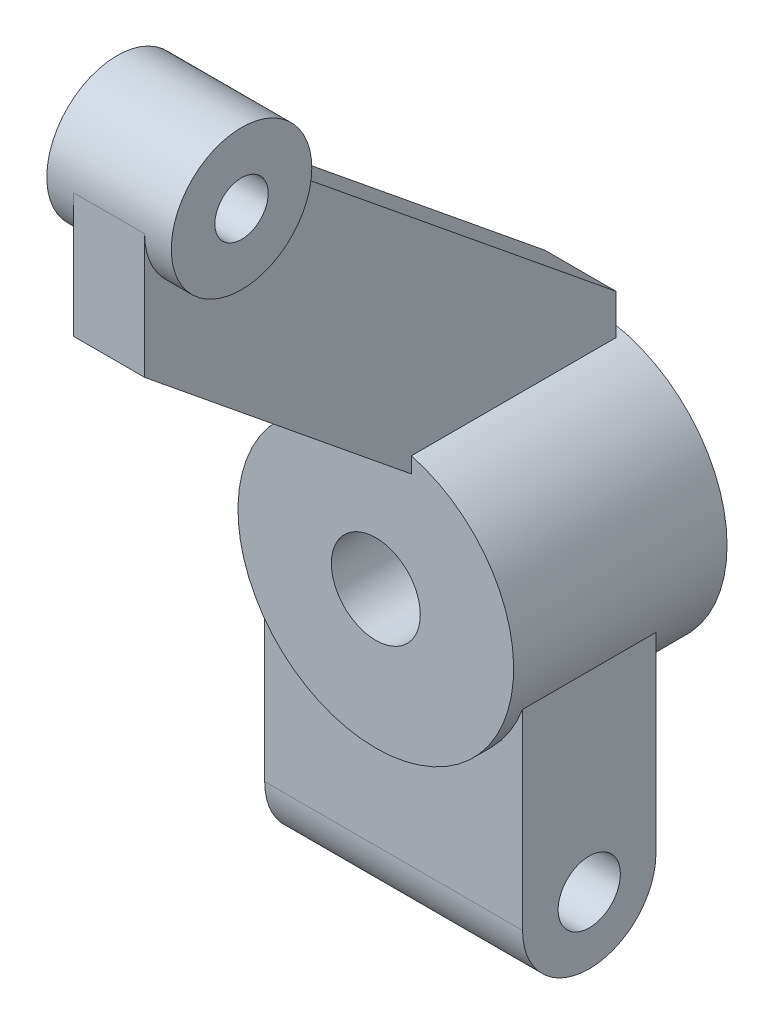
ISO-10303-21;
HEADER;
FILE_DESCRIPTION(('STEP AP214'),'2;1');
FILE_NAME('part.step','',(''),(''),'','','');
FILE_SCHEMA(('AUTOMOTIVE_DESIGN { 1 0 10303 214 1 1 1 1 }'));
ENDSEC;
DATA;
#1=APPLICATION_CONTEXT('core data for automotive mechanical design processes');
#2=APPLICATION_PROTOCOL_DEFINITION('international standard','automotive_design',2000,#1);
#3=PRODUCT_CONTEXT('',#1,'mechanical');
#4=PRODUCT('Part','Part','',(#3));
#5=PRODUCT_RELATED_PRODUCT_CATEGORY('part','',(#4));
#6=PRODUCT_DEFINITION_FORMATION('','',#4);
#7=PRODUCT_DEFINITION_CONTEXT('part definition',#1,'design');
#8=PRODUCT_DEFINITION('design','',#6,#7);
#9=PRODUCT_DEFINITION_SHAPE('','',#8);
#10=(LENGTH_UNIT() NAMED_UNIT(*) SI_UNIT(.MILLI.,.METRE.));
#11=(NAMED_UNIT(*) PLANE_ANGLE_UNIT() SI_UNIT($,.RADIAN.));
#12=(NAMED_UNIT(*) SI_UNIT($,.STERADIAN.) SOLID_ANGLE_UNIT());
#13=UNCERTAINTY_MEASURE_WITH_UNIT(LENGTH_MEASURE(1.E-05),#10,'distance_accuracy_value','');
#14=(GEOMETRIC_REPRESENTATION_CONTEXT(3) GLOBAL_UNCERTAINTY_ASSIGNED_CONTEXT((#13)) GLOBAL_UNIT_ASSIGNED_CONTEXT((#10,
#11,#12)) REPRESENTATION_CONTEXT('',''));
#15=CARTESIAN_POINT('',(0.,0.,0.));
#16=DIRECTION('',(0.,0.,1.));
#17=DIRECTION('',(1.,0.,0.));
#18=AXIS2_PLACEMENT_3D('',#15,#16,#17);
#19=CARTESIAN_POINT('',(2.,25.8,23.05));
#20=DIRECTION('',(-1.,0.,0.));
#21=DIRECTION('',(0.,0.,1.));
#22=AXIS2_PLACEMENT_3D('',#19,#20,#21);
#23=PLANE('',#22);
#24=CARTESIAN_POINT('',(2.,25.8,23.05));
#25=DIRECTION('',(-1.,0.,0.));
#26=DIRECTION('',(0.,0.,1.));
#27=AXIS2_PLACEMENT_3D('',#24,#25,#26);
#28=CIRCLE('',#27,3.95);
#29=CARTESIAN_POINT('',(2.,25.8,27.));
#30=VERTEX_POINT('',#29);
#31=CARTESIAN_POINT('',(2.,24.9568903220212,19.1910278478721));
#32=VERTEX_POINT('',#31);
#33=EDGE_CURVE('E132',#30,#32,#28,.F.);
#34=ORIENTED_EDGE('',*,*,#33,.F.);
#35=DIRECTION('',(0.,-1.,0.));
#36=VECTOR('',#35,1.);
#37=CARTESIAN_POINT('',(2.,18.8053632426681,27.));
#38=LINE('',#37,#36);
#39=CARTESIAN_POINT('',(2.,18.8053632426681,27.));
#40=VERTEX_POINT('',#39);
#41=EDGE_CURVE('E114',#30,#40,#38,.T.);
#42=ORIENTED_EDGE('',*,*,#41,.T.);
#43=DIRECTION('',(0.,-0.631103209350347,-0.775698871436391));
#44=VECTOR('',#43,1.);
#45=CARTESIAN_POINT('',(2.,6.60146751864099,12.));
#46=LINE('',#45,#44);
#47=CARTESIAN_POINT('',(2.,6.60146751864099,12.));
#48=VERTEX_POINT('',#47);
#49=EDGE_CURVE('E147',#40,#48,#46,.T.);
#50=ORIENTED_EDGE('',*,*,#49,.T.);
#51=DIRECTION('',(0.,-1.,0.));
#52=VECTOR('',#51,1.);
#53=CARTESIAN_POINT('',(2.,0.,12.));
#54=LINE('',#53,#52);
#55=CARTESIAN_POINT('',(2.,7.48748956593597,12.));
#56=VERTEX_POINT('',#55);
#57=EDGE_CURVE('E41',#56,#48,#54,.T.);
#58=ORIENTED_EDGE('',*,*,#57,.F.);
#59=DIRECTION('',(0.,0.,-1.));
#60=VECTOR('',#59,1.);
#61=CARTESIAN_POINT('',(2.,7.48748956593597,12.));
#62=LINE('',#61,#60);
#63=CARTESIAN_POINT('',(2.,7.48748956593597,0.500000000000002));
#64=VERTEX_POINT('',#63);
#65=EDGE_CURVE('E166',#56,#64,#62,.T.);
#66=ORIENTED_EDGE('',*,*,#65,.T.);
#67=DIRECTION('',(0.,1.,0.));
#68=VECTOR('',#67,1.);
#69=CARTESIAN_POINT('',(2.,9.75,0.500000000000002));
#70=LINE('',#69,#68);
#71=CARTESIAN_POINT('',(2.,9.75,0.500000000000002));
#72=VERTEX_POINT('',#71);
#73=EDGE_CURVE('E149',#64,#72,#70,.T.);
#74=ORIENTED_EDGE('',*,*,#73,.T.);
#75=DIRECTION('',(0.,0.631103209350347,0.775698871436391));
#76=VECTOR('',#75,1.);
#77=CARTESIAN_POINT('',(2.,24.9568903220212,19.1910278478721));
#78=LINE('',#77,#76);
#79=EDGE_CURVE('E125',#72,#32,#78,.T.);
#80=ORIENTED_EDGE('',*,*,#79,.T.);
#81=EDGE_LOOP('',(#34,#42,#50,#58,#66,#74,#80));
#82=FACE_BOUND('',#81,.T.);
#83=ADVANCED_FACE('F32',(#82),#23,.F.);
#84=CARTESIAN_POINT('',(-2.,25.8,23.05));
#85=DIRECTION('',(-1.,0.,0.));
#86=DIRECTION('',(0.,0.,1.));
#87=AXIS2_PLACEMENT_3D('',#84,#85,#86);
#88=PLANE('',#87);
#89=DIRECTION('',(0.,-1.,0.));
#90=VECTOR('',#89,1.);
#91=CARTESIAN_POINT('',(-2.,18.8053632426681,27.));
#92=LINE('',#91,#90);
#93=CARTESIAN_POINT('',(-2.,25.8,27.));
#94=VERTEX_POINT('',#93);
#95=CARTESIAN_POINT('',(-2.,18.8053632426681,27.));
#96=VERTEX_POINT('',#95);
#97=EDGE_CURVE('E150',#94,#96,#92,.T.);
#98=ORIENTED_EDGE('',*,*,#97,.F.);
#99=CARTESIAN_POINT('',(-2.,25.8,23.05));
#100=DIRECTION('',(-1.,0.,0.));
#101=DIRECTION('',(0.,0.,1.));
#102=AXIS2_PLACEMENT_3D('',#99,#100,#101);
#103=CIRCLE('',#102,3.95);
#104=CARTESIAN_POINT('',(-2.,24.9568903220212,19.1910278478721));
#105=VERTEX_POINT('',#104);
#106=EDGE_CURVE('E133',#94,#105,#103,.F.);
#107=ORIENTED_EDGE('',*,*,#106,.T.);
#108=DIRECTION('',(0.,0.631103209350347,0.775698871436391));
#109=VECTOR('',#108,1.);
#110=CARTESIAN_POINT('',(-2.,24.9568903220212,19.1910278478721));
#111=LINE('',#110,#109);
#112=CARTESIAN_POINT('',(-2.,9.75,0.500000000000002));
#113=VERTEX_POINT('',#112);
#114=EDGE_CURVE('E154',#113,#105,#111,.T.);
#115=ORIENTED_EDGE('',*,*,#114,.F.);
#116=DIRECTION('',(0.,1.,0.));
#117=VECTOR('',#116,1.);
#118=CARTESIAN_POINT('',(-2.,9.75,0.500000000000002));
#119=LINE('',#118,#117);
#120=CARTESIAN_POINT('',(-2.,7.48748956593597,0.500000000000002));
#121=VERTEX_POINT('',#120);
#122=EDGE_CURVE('E141',#121,#113,#119,.T.);
#123=ORIENTED_EDGE('',*,*,#122,.F.);
#124=DIRECTION('',(0.,0.,-1.));
#125=VECTOR('',#124,1.);
#126=CARTESIAN_POINT('',(-2.,7.48748956593597,12.));
#127=LINE('',#126,#125);
#128=CARTESIAN_POINT('',(-2.,7.48748956593597,12.));
#129=VERTEX_POINT('',#128);
#130=EDGE_CURVE('E52',#129,#121,#127,.T.);
#131=ORIENTED_EDGE('',*,*,#130,.F.);
#132=DIRECTION('',(0.,-1.,0.));
#133=VECTOR('',#132,1.);
#134=CARTESIAN_POINT('',(-2.,0.,12.));
#135=LINE('',#134,#133);
#136=CARTESIAN_POINT('',(-2.,6.60146751864099,12.));
#137=VERTEX_POINT('',#136);
#138=EDGE_CURVE('E204',#129,#137,#135,.T.);
#139=ORIENTED_EDGE('',*,*,#138,.T.);
#140=DIRECTION('',(0.,-0.631103209350347,-0.775698871436391));
#141=VECTOR('',#140,1.);
#142=CARTESIAN_POINT('',(-2.,6.60146751864099,12.));
#143=LINE('',#142,#141);
#144=EDGE_CURVE('E138',#96,#137,#143,.T.);
#145=ORIENTED_EDGE('',*,*,#144,.F.);
#146=EDGE_LOOP('',(#98,#107,#115,#123,#131,#139,#145));
#147=FACE_BOUND('',#146,.T.);
#148=ADVANCED_FACE('F249',(#147),#88,.T.);
#149=CARTESIAN_POINT('',(0.,0.,12.));
#150=DIRECTION('',(0.,0.,-1.));
#151=DIRECTION('',(-1.,0.,0.));
#152=AXIS2_PLACEMENT_3D('',#149,#150,#151);
#153=CYLINDRICAL_SURFACE('',#152,7.75);
#154=DIRECTION('',(0.,0.,-1.));
#155=VECTOR('',#154,1.);
#156=CARTESIAN_POINT('',(7.25,-2.73861278752583,12.));
#157=LINE('',#156,#155);
#158=CARTESIAN_POINT('',(7.25,-2.73861278752583,3.5));
#159=VERTEX_POINT('',#158);
#160=CARTESIAN_POINT('',(7.25,-2.73861278752583,11.));
#161=VERTEX_POINT('',#160);
#162=EDGE_CURVE('E202',#159,#161,#157,.F.);
#163=ORIENTED_EDGE('',*,*,#162,.F.);
#164=CARTESIAN_POINT('',(0.,0.,3.5));
#165=DIRECTION('',(0.,0.,1.));
#166=DIRECTION('',(0.,-1.,0.));
#167=AXIS2_PLACEMENT_3D('',#164,#165,#166);
#168=CIRCLE('',#167,7.75);
#169=CARTESIAN_POINT('',(-7.25,-2.73861278752583,3.5));
#170=VERTEX_POINT('',#169);
#171=EDGE_CURVE('E197',#170,#159,#168,.T.);
#172=ORIENTED_EDGE('',*,*,#171,.F.);
#173=DIRECTION('',(0.,0.,-1.));
#174=VECTOR('',#173,1.);
#175=CARTESIAN_POINT('',(-7.25,-2.73861278752583,12.));
#176=LINE('',#175,#174);
#177=CARTESIAN_POINT('',(-7.25,-2.73861278752583,11.));
#178=VERTEX_POINT('',#177);
#179=EDGE_CURVE('E192',#170,#178,#176,.F.);
#180=ORIENTED_EDGE('',*,*,#179,.T.);
#181=CARTESIAN_POINT('',(0.,0.,11.));
#182=DIRECTION('',(0.,0.,-1.));
#183=DIRECTION('',(0.,1.,0.));
#184=AXIS2_PLACEMENT_3D('',#181,#182,#183);
#185=CIRCLE('',#184,7.75);
#186=EDGE_CURVE('E199',#161,#178,#185,.T.);
#187=ORIENTED_EDGE('',*,*,#186,.F.);
#188=EDGE_LOOP('',(#163,#172,#180,#187));
#189=FACE_BOUND('',#188,.T.);
#190=CARTESIAN_POINT('',(0.,0.,0.));
#191=DIRECTION('',(0.,0.,1.));
#192=DIRECTION('',(1.,0.,0.));
#193=AXIS2_PLACEMENT_3D('',#190,#191,#192);
#194=CIRCLE('',#193,7.75);
#195=CARTESIAN_POINT('',(7.75,0.,0.));
#196=VERTEX_POINT('',#195);
#197=EDGE_CURVE('E188',#196,#196,#194,.T.);
#198=ORIENTED_EDGE('',*,*,#197,.T.);
#199=EDGE_LOOP('',(#198));
#200=FACE_BOUND('',#199,.T.);
#201=ORIENTED_EDGE('',*,*,#65,.F.);
#202=CARTESIAN_POINT('',(0.,0.,12.));
#203=DIRECTION('',(0.,0.,1.));
#204=DIRECTION('',(1.,0.,0.));
#205=AXIS2_PLACEMENT_3D('',#202,#203,#204);
#206=CIRCLE('',#205,7.75);
#207=EDGE_CURVE('E189',#129,#56,#206,.T.);
#208=ORIENTED_EDGE('',*,*,#207,.F.);
#209=ORIENTED_EDGE('',*,*,#130,.T.);
#210=CARTESIAN_POINT('',(0.,0.,0.500000000000002));
#211=DIRECTION('',(0.,0.,1.));
#212=DIRECTION('',(1.,0.,0.));
#213=AXIS2_PLACEMENT_3D('',#210,#211,#212);
#214=CIRCLE('',#213,7.75);
#215=EDGE_CURVE('E11',#64,#121,#214,.T.);
#216=ORIENTED_EDGE('',*,*,#215,.F.);
#217=EDGE_LOOP('',(#201,#208,#209,#216));
#218=FACE_BOUND('',#217,.T.);
#219=ADVANCED_FACE('F34',(#189,#200,#218),#153,.T.);
#220=CARTESIAN_POINT('',(0.,0.,12.));
#221=DIRECTION('',(0.,0.,1.));
#222=DIRECTION('',(1.,0.,0.));
#223=AXIS2_PLACEMENT_3D('',#220,#221,#222);
#224=PLANE('',#223);
#225=CARTESIAN_POINT('',(0.,0.,12.));
#226=DIRECTION('',(0.,0.,1.));
#227=DIRECTION('',(1.,0.,0.));
#228=AXIS2_PLACEMENT_3D('',#225,#226,#227);
#229=CIRCLE('',#228,2.5);
#230=CARTESIAN_POINT('',(2.5,0.,12.));
#231=VERTEX_POINT('',#230);
#232=EDGE_CURVE('E220',#231,#231,#229,.T.);
#233=ORIENTED_EDGE('',*,*,#232,.F.);
#234=EDGE_LOOP('',(#233));
#235=FACE_BOUND('',#234,.T.);
#236=ORIENTED_EDGE('',*,*,#207,.T.);
#237=ORIENTED_EDGE('',*,*,#57,.T.);
#238=DIRECTION('',(-1.,0.,0.));
#239=VECTOR('',#238,1.);
#240=CARTESIAN_POINT('',(2.,6.60146751864099,12.));
#241=LINE('',#240,#239);
#242=EDGE_CURVE('E163',#48,#137,#241,.T.);
#243=ORIENTED_EDGE('',*,*,#242,.T.);
#244=ORIENTED_EDGE('',*,*,#138,.F.);
#245=EDGE_LOOP('',(#236,#237,#243,#244));
#246=FACE_BOUND('',#245,.T.);
#247=ADVANCED_FACE('F291',(#235,#246),#224,.T.);
#248=CARTESIAN_POINT('',(0.,0.,0.));
#249=DIRECTION('',(0.,0.,1.));
#250=DIRECTION('',(1.,0.,0.));
#251=AXIS2_PLACEMENT_3D('',#248,#249,#250);
#252=PLANE('',#251);
#253=CARTESIAN_POINT('',(0.,0.,0.));
#254=DIRECTION('',(0.,0.,-1.));
#255=DIRECTION('',(-1.,0.,0.));
#256=AXIS2_PLACEMENT_3D('',#253,#254,#255);
#257=CIRCLE('',#256,2.5);
#258=CARTESIAN_POINT('',(-2.5,0.,0.));
#259=VERTEX_POINT('',#258);
#260=EDGE_CURVE('E225',#259,#259,#257,.T.);
#261=ORIENTED_EDGE('',*,*,#260,.F.);
#262=EDGE_LOOP('',(#261));
#263=FACE_BOUND('',#262,.T.);
#264=ORIENTED_EDGE('',*,*,#197,.F.);
#265=EDGE_LOOP('',(#264));
#266=FACE_BOUND('',#265,.T.);
#267=ADVANCED_FACE('F275',(#263,#266),#252,.F.);
#268=CARTESIAN_POINT('',(7.25,-13.5,7.25));
#269=DIRECTION('',(-1.,0.,0.));
#270=DIRECTION('',(0.,0.,1.));
#271=AXIS2_PLACEMENT_3D('',#268,#269,#270);
#272=PLANE('',#271);
#273=CARTESIAN_POINT('',(7.25,-13.5,7.25));
#274=DIRECTION('',(1.,0.,0.));
#275=DIRECTION('',(0.,0.,-1.));
#276=AXIS2_PLACEMENT_3D('',#273,#274,#275);
#277=CIRCLE('',#276,1.75);
#278=CARTESIAN_POINT('',(7.25,-13.5,5.5));
#279=VERTEX_POINT('',#278);
#280=EDGE_CURVE('E216',#279,#279,#277,.T.);
#281=ORIENTED_EDGE('',*,*,#280,.F.);
#282=EDGE_LOOP('',(#281));
#283=FACE_BOUND('',#282,.T.);
#284=DIRECTION('',(0.,1.,0.));
#285=VECTOR('',#284,1.);
#286=CARTESIAN_POINT('',(7.25,-2.01389562926302,3.5));
#287=LINE('',#286,#285);
#288=CARTESIAN_POINT('',(7.25,-13.5,3.5));
#289=VERTEX_POINT('',#288);
#290=EDGE_CURVE('E174',#289,#159,#287,.T.);
#291=ORIENTED_EDGE('',*,*,#290,.T.);
#292=ORIENTED_EDGE('',*,*,#162,.T.);
#293=DIRECTION('',(0.,-1.,0.));
#294=VECTOR('',#293,1.);
#295=CARTESIAN_POINT('',(7.25,-2.01389562926302,11.));
#296=LINE('',#295,#294);
#297=CARTESIAN_POINT('',(7.25,-13.5,11.));
#298=VERTEX_POINT('',#297);
#299=EDGE_CURVE('E169',#161,#298,#296,.T.);
#300=ORIENTED_EDGE('',*,*,#299,.T.);
#301=CARTESIAN_POINT('',(7.25,-13.5,7.25));
#302=DIRECTION('',(1.,0.,0.));
#303=DIRECTION('',(0.,0.,1.));
#304=AXIS2_PLACEMENT_3D('',#301,#302,#303);
#305=CIRCLE('',#304,3.75);
#306=EDGE_CURVE('E171',#298,#289,#305,.T.);
#307=ORIENTED_EDGE('',*,*,#306,.T.);
#308=EDGE_LOOP('',(#291,#292,#300,#307));
#309=FACE_BOUND('',#308,.T.);
#310=ADVANCED_FACE('F271',(#283,#309),#272,.F.);
#311=CARTESIAN_POINT('',(-7.25,-13.5,7.25));
#312=DIRECTION('',(-1.,0.,0.));
#313=DIRECTION('',(0.,0.,1.));
#314=AXIS2_PLACEMENT_3D('',#311,#312,#313);
#315=PLANE('',#314);
#316=CARTESIAN_POINT('',(-7.25,-13.5,7.25));
#317=DIRECTION('',(-1.,0.,0.));
#318=DIRECTION('',(0.,0.,1.));
#319=AXIS2_PLACEMENT_3D('',#316,#317,#318);
#320=CIRCLE('',#319,1.75);
#321=CARTESIAN_POINT('',(-7.25,-13.5,9.));
#322=VERTEX_POINT('',#321);
#323=EDGE_CURVE('E36',#322,#322,#320,.T.);
#324=ORIENTED_EDGE('',*,*,#323,.F.);
#325=EDGE_LOOP('',(#324));
#326=FACE_BOUND('',#325,.T.);
#327=ORIENTED_EDGE('',*,*,#179,.F.);
#328=DIRECTION('',(0.,1.,0.));
#329=VECTOR('',#328,1.);
#330=CARTESIAN_POINT('',(-7.25,-2.01389562926302,3.5));
#331=LINE('',#330,#329);
#332=CARTESIAN_POINT('',(-7.25,-13.5,3.5));
#333=VERTEX_POINT('',#332);
#334=EDGE_CURVE('E172',#333,#170,#331,.T.);
#335=ORIENTED_EDGE('',*,*,#334,.F.);
#336=CARTESIAN_POINT('',(-7.25,-13.5,7.25));
#337=DIRECTION('',(1.,0.,0.));
#338=DIRECTION('',(0.,0.,1.));
#339=AXIS2_PLACEMENT_3D('',#336,#337,#338);
#340=CIRCLE('',#339,3.75);
#341=CARTESIAN_POINT('',(-7.25,-13.5,11.));
#342=VERTEX_POINT('',#341);
#343=EDGE_CURVE('E179',#342,#333,#340,.T.);
#344=ORIENTED_EDGE('',*,*,#343,.F.);
#345=DIRECTION('',(0.,-1.,0.));
#346=VECTOR('',#345,1.);
#347=CARTESIAN_POINT('',(-7.25,-2.01389562926302,11.));
#348=LINE('',#347,#346);
#349=EDGE_CURVE('E168',#178,#342,#348,.T.);
#350=ORIENTED_EDGE('',*,*,#349,.F.);
#351=EDGE_LOOP('',(#327,#335,#344,#350));
#352=FACE_BOUND('',#351,.T.);
#353=ADVANCED_FACE('F274',(#326,#352),#315,.T.);
#354=CARTESIAN_POINT('',(7.25,-2.01389562926302,11.));
#355=DIRECTION('',(0.,0.,-1.));
#356=DIRECTION('',(0.,1.,0.));
#357=AXIS2_PLACEMENT_3D('',#354,#355,#356);
#358=PLANE('',#357);
#359=ORIENTED_EDGE('',*,*,#299,.F.);
#360=ORIENTED_EDGE('',*,*,#186,.T.);
#361=ORIENTED_EDGE('',*,*,#349,.T.);
#362=DIRECTION('',(-1.,0.,0.));
#363=VECTOR('',#362,1.);
#364=CARTESIAN_POINT('',(7.25,-13.5,11.));
#365=LINE('',#364,#363);
#366=EDGE_CURVE('E185',#298,#342,#365,.T.);
#367=ORIENTED_EDGE('',*,*,#366,.F.);
#368=EDGE_LOOP('',(#359,#360,#361,#367));
#369=FACE_BOUND('',#368,.T.);
#370=ADVANCED_FACE('F279',(#369),#358,.F.);
#371=CARTESIAN_POINT('',(7.25,-13.5,7.25));
#372=DIRECTION('',(-1.,0.,0.));
#373=DIRECTION('',(0.,0.,1.));
#374=AXIS2_PLACEMENT_3D('',#371,#372,#373);
#375=CYLINDRICAL_SURFACE('',#374,3.75);
#376=ORIENTED_EDGE('',*,*,#343,.T.);
#377=DIRECTION('',(-1.,0.,0.));
#378=VECTOR('',#377,1.);
#379=CARTESIAN_POINT('',(7.25,-13.5,3.5));
#380=LINE('',#379,#378);
#381=EDGE_CURVE('E177',#289,#333,#380,.T.);
#382=ORIENTED_EDGE('',*,*,#381,.F.);
#383=ORIENTED_EDGE('',*,*,#306,.F.);
#384=ORIENTED_EDGE('',*,*,#366,.T.);
#385=EDGE_LOOP('',(#376,#382,#383,#384));
#386=FACE_BOUND('',#385,.T.);
#387=ADVANCED_FACE('F283',(#386),#375,.T.);
#388=CARTESIAN_POINT('',(7.25,-2.01389562926302,3.5));
#389=DIRECTION('',(0.,0.,1.));
#390=DIRECTION('',(0.,-1.,0.));
#391=AXIS2_PLACEMENT_3D('',#388,#389,#390);
#392=PLANE('',#391);
#393=ORIENTED_EDGE('',*,*,#334,.T.);
#394=ORIENTED_EDGE('',*,*,#171,.T.);
#395=ORIENTED_EDGE('',*,*,#290,.F.);
#396=ORIENTED_EDGE('',*,*,#381,.T.);
#397=EDGE_LOOP('',(#393,#394,#395,#396));
#398=FACE_BOUND('',#397,.T.);
#399=ADVANCED_FACE('F269',(#398),#392,.F.);
#400=CARTESIAN_POINT('',(2.,6.60146751864099,12.));
#401=DIRECTION('',(0.,0.775698871436392,-0.631103209350347));
#402=DIRECTION('',(0.,0.631103209350347,0.775698871436392));
#403=AXIS2_PLACEMENT_3D('',#400,#401,#402);
#404=PLANE('',#403);
#405=ORIENTED_EDGE('',*,*,#144,.T.);
#406=ORIENTED_EDGE('',*,*,#242,.F.);
#407=ORIENTED_EDGE('',*,*,#49,.F.);
#408=DIRECTION('',(-1.,0.,0.));
#409=VECTOR('',#408,1.);
#410=CARTESIAN_POINT('',(2.,18.8053632426681,27.));
#411=LINE('',#410,#409);
#412=EDGE_CURVE('E120',#40,#96,#411,.T.);
#413=ORIENTED_EDGE('',*,*,#412,.T.);
#414=EDGE_LOOP('',(#405,#406,#407,#413));
#415=FACE_BOUND('',#414,.T.);
#416=ADVANCED_FACE('F265',(#415),#404,.F.);
#417=CARTESIAN_POINT('',(2.,9.75,0.500000000000002));
#418=DIRECTION('',(0.,0.,1.));
#419=DIRECTION('',(1.,0.,0.));
#420=AXIS2_PLACEMENT_3D('',#417,#418,#419);
#421=PLANE('',#420);
#422=ORIENTED_EDGE('',*,*,#73,.F.);
#423=ORIENTED_EDGE('',*,*,#215,.T.);
#424=ORIENTED_EDGE('',*,*,#122,.T.);
#425=DIRECTION('',(-1.,0.,0.));
#426=VECTOR('',#425,1.);
#427=CARTESIAN_POINT('',(2.,9.75,0.500000000000002));
#428=LINE('',#427,#426);
#429=EDGE_CURVE('E160',#72,#113,#428,.T.);
#430=ORIENTED_EDGE('',*,*,#429,.F.);
#431=EDGE_LOOP('',(#422,#423,#424,#430));
#432=FACE_BOUND('',#431,.T.);
#433=ADVANCED_FACE('F261',(#432),#421,.F.);
#434=CARTESIAN_POINT('',(2.,24.9568903220212,19.1910278478721));
#435=DIRECTION('',(0.,-0.775698871436392,0.631103209350347));
#436=DIRECTION('',(0.,-0.631103209350347,-0.775698871436392));
#437=AXIS2_PLACEMENT_3D('',#434,#435,#436);
#438=PLANE('',#437);
#439=ORIENTED_EDGE('',*,*,#114,.T.);
#440=DIRECTION('',(-1.,0.,0.));
#441=VECTOR('',#440,1.);
#442=CARTESIAN_POINT('',(2.,24.9568903220212,19.1910278478721));
#443=LINE('',#442,#441);
#444=EDGE_CURVE('E134',#32,#105,#443,.T.);
#445=ORIENTED_EDGE('',*,*,#444,.F.);
#446=ORIENTED_EDGE('',*,*,#79,.F.);
#447=ORIENTED_EDGE('',*,*,#429,.T.);
#448=EDGE_LOOP('',(#439,#445,#446,#447));
#449=FACE_BOUND('',#448,.T.);
#450=ADVANCED_FACE('F258',(#449),#438,.F.);
#451=CARTESIAN_POINT('',(2.,25.8,23.05));
#452=DIRECTION('',(-1.,0.,0.));
#453=DIRECTION('',(0.,0.,1.));
#454=AXIS2_PLACEMENT_3D('',#451,#452,#453);
#455=CYLINDRICAL_SURFACE('',#454,3.95);
#456=ORIENTED_EDGE('',*,*,#444,.T.);
#457=ORIENTED_EDGE('',*,*,#106,.F.);
#458=DIRECTION('',(-1.,0.,0.));
#459=VECTOR('',#458,1.);
#460=CARTESIAN_POINT('',(2.,25.8,27.));
#461=LINE('',#460,#459);
#462=EDGE_CURVE('E117',#30,#94,#461,.T.);
#463=ORIENTED_EDGE('',*,*,#462,.F.);
#464=ORIENTED_EDGE('',*,*,#33,.T.);
#465=EDGE_LOOP('',(#456,#457,#463,#464));
#466=FACE_BOUND('',#465,.T.);
#467=CARTESIAN_POINT('',(-3.5,25.8,23.05));
#468=DIRECTION('',(1.,0.,0.));
#469=DIRECTION('',(0.,0.,-1.));
#470=AXIS2_PLACEMENT_3D('',#467,#468,#469);
#471=CIRCLE('',#470,3.95);
#472=CARTESIAN_POINT('',(-3.5,25.8,19.1));
#473=VERTEX_POINT('',#472);
#474=EDGE_CURVE('E213',#473,#473,#471,.T.);
#475=ORIENTED_EDGE('',*,*,#474,.T.);
#476=EDGE_LOOP('',(#475));
#477=FACE_BOUND('',#476,.T.);
#478=CARTESIAN_POINT('',(3.5,25.8,23.05));
#479=DIRECTION('',(1.,0.,0.));
#480=DIRECTION('',(0.,0.,-1.));
#481=AXIS2_PLACEMENT_3D('',#478,#479,#480);
#482=CIRCLE('',#481,3.95);
#483=CARTESIAN_POINT('',(3.5,25.8,19.1));
#484=VERTEX_POINT('',#483);
#485=EDGE_CURVE('E143',#484,#484,#482,.T.);
#486=ORIENTED_EDGE('',*,*,#485,.F.);
#487=EDGE_LOOP('',(#486));
#488=FACE_BOUND('',#487,.T.);
#489=ADVANCED_FACE('F130',(#466,#477,#488),#455,.T.);
#490=CARTESIAN_POINT('',(2.,18.8053632426681,27.));
#491=DIRECTION('',(0.,0.,-1.));
#492=DIRECTION('',(-1.,0.,0.));
#493=AXIS2_PLACEMENT_3D('',#490,#491,#492);
#494=PLANE('',#493);
#495=ORIENTED_EDGE('',*,*,#97,.T.);
#496=ORIENTED_EDGE('',*,*,#412,.F.);
#497=ORIENTED_EDGE('',*,*,#41,.F.);
#498=ORIENTED_EDGE('',*,*,#462,.T.);
#499=EDGE_LOOP('',(#495,#496,#497,#498));
#500=FACE_BOUND('',#499,.T.);
#501=ADVANCED_FACE('F116',(#500),#494,.F.);
#502=CARTESIAN_POINT('',(-3.5,25.8,23.05));
#503=DIRECTION('',(1.,0.,0.));
#504=DIRECTION('',(0.,0.,-1.));
#505=AXIS2_PLACEMENT_3D('',#502,#503,#504);
#506=PLANE('',#505);
#507=CARTESIAN_POINT('',(-3.5,25.8,23.05));
#508=DIRECTION('',(1.,0.,0.));
#509=DIRECTION('',(0.,0.,-1.));
#510=AXIS2_PLACEMENT_3D('',#507,#508,#509);
#511=CIRCLE('',#510,1.5);
#512=CARTESIAN_POINT('',(-3.5,25.8,21.55));
#513=VERTEX_POINT('',#512);
#514=EDGE_CURVE('E209',#513,#513,#511,.T.);
#515=ORIENTED_EDGE('',*,*,#514,.T.);
#516=EDGE_LOOP('',(#515));
#517=FACE_BOUND('',#516,.T.);
#518=ORIENTED_EDGE('',*,*,#474,.F.);
#519=EDGE_LOOP('',(#518));
#520=FACE_BOUND('',#519,.T.);
#521=ADVANCED_FACE('F234',(#517,#520),#506,.F.);
#522=CARTESIAN_POINT('',(3.5,25.8,23.05));
#523=DIRECTION('',(1.,0.,0.));
#524=DIRECTION('',(0.,0.,-1.));
#525=AXIS2_PLACEMENT_3D('',#522,#523,#524);
#526=PLANE('',#525);
#527=CARTESIAN_POINT('',(3.5,25.8,23.05));
#528=DIRECTION('',(1.,0.,0.));
#529=DIRECTION('',(0.,0.,-1.));
#530=AXIS2_PLACEMENT_3D('',#527,#528,#529);
#531=CIRCLE('',#530,1.5);
#532=CARTESIAN_POINT('',(3.5,25.8,21.55));
#533=VERTEX_POINT('',#532);
#534=EDGE_CURVE('E207',#533,#533,#531,.T.);
#535=ORIENTED_EDGE('',*,*,#534,.F.);
#536=EDGE_LOOP('',(#535));
#537=FACE_BOUND('',#536,.T.);
#538=ORIENTED_EDGE('',*,*,#485,.T.);
#539=EDGE_LOOP('',(#538));
#540=FACE_BOUND('',#539,.T.);
#541=ADVANCED_FACE('F236',(#537,#540),#526,.T.);
#542=CARTESIAN_POINT('',(-7.75,25.8,23.05));
#543=DIRECTION('',(1.,0.,0.));
#544=DIRECTION('',(0.,0.,-1.));
#545=AXIS2_PLACEMENT_3D('',#542,#543,#544);
#546=CYLINDRICAL_SURFACE('',#545,1.5);
#547=CARTESIAN_POINT('',(3.5,25.8,21.55));
#548=CARTESIAN_POINT('',(3.42708333333333,25.8,21.55));
#549=CARTESIAN_POINT('',(3.35416666666666,25.8,21.55));
#550=CARTESIAN_POINT('',(3.20833333333333,25.8,21.55));
#551=CARTESIAN_POINT('',(3.13541666666666,25.8,21.55));
#552=CARTESIAN_POINT('',(2.98958333333333,25.8,21.55));
#553=CARTESIAN_POINT('',(2.91666666666666,25.8,21.55));
#554=CARTESIAN_POINT('',(2.77083333333333,25.8,21.55));
#555=CARTESIAN_POINT('',(2.69791666666666,25.8,21.55));
#556=CARTESIAN_POINT('',(2.55208333333333,25.8,21.55));
#557=CARTESIAN_POINT('',(2.47916666666666,25.8,21.55));
#558=CARTESIAN_POINT('',(2.33333333333333,25.8,21.55));
#559=CARTESIAN_POINT('',(2.26041666666667,25.8,21.55));
#560=CARTESIAN_POINT('',(2.11458333333333,25.8,21.55));
#561=CARTESIAN_POINT('',(2.04166666666667,25.8,21.55));
#562=CARTESIAN_POINT('',(1.89583333333333,25.8,21.55));
#563=CARTESIAN_POINT('',(1.82291666666666,25.8,21.55));
#564=CARTESIAN_POINT('',(1.67708333333333,25.8,21.55));
#565=CARTESIAN_POINT('',(1.60416666666666,25.8,21.55));
#566=CARTESIAN_POINT('',(1.45833333333333,25.8,21.55));
#567=CARTESIAN_POINT('',(1.38541666666666,25.8,21.55));
#568=CARTESIAN_POINT('',(1.23958333333333,25.8,21.55));
#569=CARTESIAN_POINT('',(1.16666666666667,25.8,21.55));
#570=CARTESIAN_POINT('',(1.02083333333333,25.8,21.55));
#571=CARTESIAN_POINT('',(0.947916666666666,25.8,21.55));
#572=CARTESIAN_POINT('',(0.802083333333332,25.8,21.55));
#573=CARTESIAN_POINT('',(0.729166666666666,25.8,21.55));
#574=CARTESIAN_POINT('',(0.583333333333332,25.8,21.55));
#575=CARTESIAN_POINT('',(0.510416666666665,25.8,21.55));
#576=CARTESIAN_POINT('',(0.364583333333332,25.8,21.55));
#577=CARTESIAN_POINT('',(0.291666666666665,25.8,21.55));
#578=CARTESIAN_POINT('',(0.145833333333332,25.8,21.55));
#579=CARTESIAN_POINT('',(0.0729166666666656,25.8,21.55));
#580=CARTESIAN_POINT('',(-0.0729166666666676,25.8,21.55));
#581=CARTESIAN_POINT('',(-0.145833333333334,25.8,21.55));
#582=CARTESIAN_POINT('',(-0.291666666666668,25.8,21.55));
#583=CARTESIAN_POINT('',(-0.364583333333335,25.8,21.55));
#584=CARTESIAN_POINT('',(-0.510416666666668,25.8,21.55));
#585=CARTESIAN_POINT('',(-0.583333333333334,25.8,21.55));
#586=CARTESIAN_POINT('',(-0.729166666666667,25.8,21.55));
#587=CARTESIAN_POINT('',(-0.802083333333334,25.8,21.55));
#588=CARTESIAN_POINT('',(-0.947916666666668,25.8,21.55));
#589=CARTESIAN_POINT('',(-1.02083333333333,25.8,21.55));
#590=CARTESIAN_POINT('',(-1.16666666666667,25.8,21.55));
#591=CARTESIAN_POINT('',(-1.23958333333333,25.8,21.55));
#592=CARTESIAN_POINT('',(-1.38541666666667,25.8,21.55));
#593=CARTESIAN_POINT('',(-1.45833333333333,25.8,21.55));
#594=CARTESIAN_POINT('',(-1.60416666666667,25.8,21.55));
#595=CARTESIAN_POINT('',(-1.67708333333333,25.8,21.55));
#596=CARTESIAN_POINT('',(-1.82291666666667,25.8,21.55));
#597=CARTESIAN_POINT('',(-1.89583333333333,25.8,21.55));
#598=CARTESIAN_POINT('',(-2.04166666666667,25.8,21.55));
#599=CARTESIAN_POINT('',(-2.11458333333333,25.8,21.55));
#600=CARTESIAN_POINT('',(-2.26041666666667,25.8,21.55));
#601=CARTESIAN_POINT('',(-2.33333333333333,25.8,21.55));
#602=CARTESIAN_POINT('',(-2.47916666666667,25.8,21.55));
#603=CARTESIAN_POINT('',(-2.55208333333333,25.8,21.55));
#604=CARTESIAN_POINT('',(-2.69791666666667,25.8,21.55));
#605=CARTESIAN_POINT('',(-2.77083333333333,25.8,21.55));
#606=CARTESIAN_POINT('',(-2.91666666666667,25.8,21.55));
#607=CARTESIAN_POINT('',(-2.98958333333333,25.8,21.55));
#608=CARTESIAN_POINT('',(-3.13541666666667,25.8,21.55));
#609=CARTESIAN_POINT('',(-3.20833333333333,25.8,21.55));
#610=CARTESIAN_POINT('',(-3.35416666666667,25.8,21.55));
#611=CARTESIAN_POINT('',(-3.42708333333333,25.8,21.55));
#612=CARTESIAN_POINT('',(-3.5,25.8,21.55));
#613=B_SPLINE_CURVE_WITH_KNOTS('',3,(#547,#548,#549,#550,#551,#552,#553,#554,#555,#556,#557,
#558,#559,#560,#561,#562,#563,#564,#565,#566,#567,#568,#569,#570,#571,#572,#573,#574,#575,#576,
#577,#578,#579,#580,#581,#582,#583,#584,#585,#586,#587,#588,#589,#590,#591,#592,#593,#594,#595,
#596,#597,#598,#599,#600,#601,#602,#603,#604,#605,#606,#607,#608,#609,#610,#611,#612),
.UNSPECIFIED.,.F.,.F.,(4,2,2,2,2,2,2,2,2,2,2,2,2,2,2,2,2,2,2,2,2,2,2,2,2,2,2,2,2,2,2,2,4),(0.,
0.21875,0.4375,0.656250000000001,0.875000000000001,1.09375,1.3125,1.53125,1.75,1.96875,2.1875,
2.40625,2.625,2.84375,3.0625,3.28125,3.5,3.71875,3.9375,4.15625,4.375,4.59375,4.8125,5.03125,
5.25,5.46875,5.6875,5.90625,6.125,6.34375,6.5625,6.78125,7.),.UNSPECIFIED.);
#614=EDGE_CURVE('BSEAM243',#533,#513,#613,.T.);
#615=ORIENTED_EDGE('',*,*,#534,.T.);
#616=ORIENTED_EDGE('',*,*,#514,.F.);
#617=ORIENTED_EDGE('',*,*,#614,.T.);
#618=ORIENTED_EDGE('',*,*,#614,.F.);
#619=EDGE_LOOP('',(#615,#617,#616,#618));
#620=FACE_BOUND('',#619,.T.);
#621=ADVANCED_FACE('F243',(#620),#546,.F.);
#622=CARTESIAN_POINT('',(-7.75,-13.5,7.25));
#623=DIRECTION('',(1.,0.,0.));
#624=DIRECTION('',(0.,0.,-1.));
#625=AXIS2_PLACEMENT_3D('',#622,#623,#624);
#626=CYLINDRICAL_SURFACE('',#625,1.75);
#627=ORIENTED_EDGE('',*,*,#323,.T.);
#628=EDGE_LOOP('',(#627));
#629=FACE_BOUND('',#628,.T.);
#630=ORIENTED_EDGE('',*,*,#280,.T.);
#631=EDGE_LOOP('',(#630));
#632=FACE_BOUND('',#631,.T.);
#633=ADVANCED_FACE('F341',(#629,#632),#626,.F.);
#634=CARTESIAN_POINT('',(0.,0.,27.));
#635=DIRECTION('',(0.,0.,-1.));
#636=DIRECTION('',(-1.,0.,0.));
#637=AXIS2_PLACEMENT_3D('',#634,#635,#636);
#638=CYLINDRICAL_SURFACE('',#637,2.5);
#639=ORIENTED_EDGE('',*,*,#232,.T.);
#640=EDGE_LOOP('',(#639));
#641=FACE_BOUND('',#640,.T.);
#642=ORIENTED_EDGE('',*,*,#260,.T.);
#643=EDGE_LOOP('',(#642));
#644=FACE_BOUND('',#643,.T.);
#645=ADVANCED_FACE('F352',(#641,#644),#638,.F.);
#646=CLOSED_SHELL('',(#83,#148,#219,#247,#267,#310,#353,#370,#387,#399,#416,#433,#450,#489,#501,
#521,#541,#621,#633,#645));
#647=MANIFOLD_SOLID_BREP('B2',#646);
#648=ADVANCED_BREP_SHAPE_REPRESENTATION('',(#18,#647),#14);
#649=SHAPE_DEFINITION_REPRESENTATION(#9,#648);
ENDSEC;
END-ISO-10303-21;
